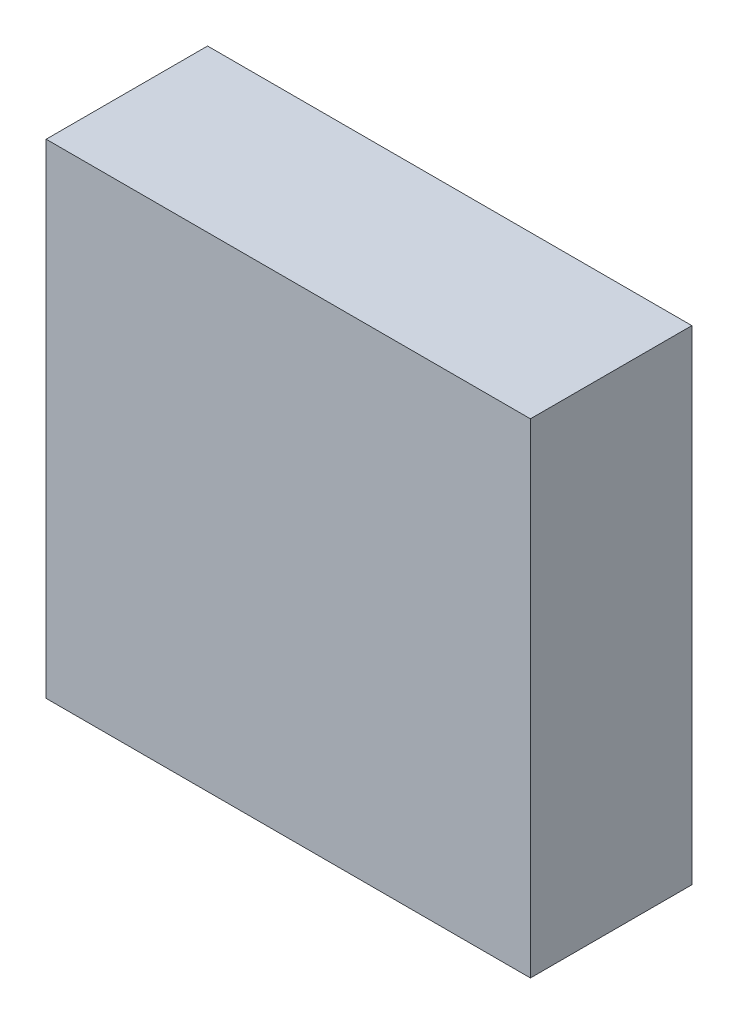
ISO-10303-21;
HEADER;
FILE_DESCRIPTION(('STEP AP214'),'2;1');
FILE_NAME('part.step','',(''),(''),'','','');
FILE_SCHEMA(('AUTOMOTIVE_DESIGN { 1 0 10303 214 1 1 1 1 }'));
ENDSEC;
DATA;
#1=APPLICATION_CONTEXT('core data for automotive mechanical design processes');
#2=APPLICATION_PROTOCOL_DEFINITION('international standard','automotive_design',2000,#1);
#3=PRODUCT_CONTEXT('',#1,'mechanical');
#4=PRODUCT('Part','Part','',(#3));
#5=PRODUCT_RELATED_PRODUCT_CATEGORY('part','',(#4));
#6=PRODUCT_DEFINITION_FORMATION('','',#4);
#7=PRODUCT_DEFINITION_CONTEXT('part definition',#1,'design');
#8=PRODUCT_DEFINITION('design','',#6,#7);
#9=PRODUCT_DEFINITION_SHAPE('','',#8);
#10=(LENGTH_UNIT() NAMED_UNIT(*) SI_UNIT(.MILLI.,.METRE.));
#11=(NAMED_UNIT(*) PLANE_ANGLE_UNIT() SI_UNIT($,.RADIAN.));
#12=(NAMED_UNIT(*) SI_UNIT($,.STERADIAN.) SOLID_ANGLE_UNIT());
#13=UNCERTAINTY_MEASURE_WITH_UNIT(LENGTH_MEASURE(1.E-05),#10,'distance_accuracy_value','');
#14=(GEOMETRIC_REPRESENTATION_CONTEXT(3) GLOBAL_UNCERTAINTY_ASSIGNED_CONTEXT((#13)) GLOBAL_UNIT_ASSIGNED_CONTEXT((#10,
#11,#12)) REPRESENTATION_CONTEXT('',''));
#15=CARTESIAN_POINT('',(0.,0.,0.));
#16=DIRECTION('',(0.,0.,1.));
#17=DIRECTION('',(1.,0.,0.));
#18=AXIS2_PLACEMENT_3D('',#15,#16,#17);
#19=CARTESIAN_POINT('',(1.49998176,-1.49998176,0.));
#20=DIRECTION('',(0.,0.,-1.));
#21=DIRECTION('',(-1.,0.,0.));
#22=AXIS2_PLACEMENT_3D('',#19,#20,#21);
#23=PLANE('',#22);
#24=DIRECTION('',(1.,0.,0.));
#25=VECTOR('',#24,1.);
#26=CARTESIAN_POINT('',(1.49998176,1.49998176,0.));
#27=LINE('',#26,#25);
#28=CARTESIAN_POINT('',(-1.49998176,1.49998176,0.));
#29=VERTEX_POINT('',#28);
#30=CARTESIAN_POINT('',(1.49998176,1.49998176,0.));
#31=VERTEX_POINT('',#30);
#32=EDGE_CURVE('E75',#29,#31,#27,.T.);
#33=ORIENTED_EDGE('',*,*,#32,.T.);
#34=DIRECTION('',(0.,1.,0.));
#35=VECTOR('',#34,1.);
#36=CARTESIAN_POINT('',(1.49998176,-1.49998176,0.));
#37=LINE('',#36,#35);
#38=CARTESIAN_POINT('',(1.49998176,-1.49998176,0.));
#39=VERTEX_POINT('',#38);
#40=EDGE_CURVE('E57',#31,#39,#37,.F.);
#41=ORIENTED_EDGE('',*,*,#40,.T.);
#42=DIRECTION('',(1.,0.,0.));
#43=VECTOR('',#42,1.);
#44=CARTESIAN_POINT('',(-1.49998176,-1.49998176,0.));
#45=LINE('',#44,#43);
#46=CARTESIAN_POINT('',(-1.49998176,-1.49998176,0.));
#47=VERTEX_POINT('',#46);
#48=EDGE_CURVE('E19',#39,#47,#45,.F.);
#49=ORIENTED_EDGE('',*,*,#48,.T.);
#50=DIRECTION('',(0.,1.,0.));
#51=VECTOR('',#50,1.);
#52=CARTESIAN_POINT('',(-1.49998176,1.49998176,0.));
#53=LINE('',#52,#51);
#54=EDGE_CURVE('E54',#47,#29,#53,.T.);
#55=ORIENTED_EDGE('',*,*,#54,.T.);
#56=EDGE_LOOP('',(#33,#41,#49,#55));
#57=FACE_BOUND('',#56,.T.);
#58=ADVANCED_FACE('F16',(#57),#23,.T.);
#59=CARTESIAN_POINT('',(-1.49998176,-1.49998176,0.));
#60=DIRECTION('',(0.,1.,0.));
#61=DIRECTION('',(0.,0.,1.));
#62=AXIS2_PLACEMENT_3D('',#59,#60,#61);
#63=PLANE('',#62);
#64=DIRECTION('',(0.,0.,1.));
#65=VECTOR('',#64,1.);
#66=CARTESIAN_POINT('',(1.49998176,-1.49998176,0.));
#67=LINE('',#66,#65);
#68=CARTESIAN_POINT('',(1.49998176,-1.49998176,1.00000054));
#69=VERTEX_POINT('',#68);
#70=EDGE_CURVE('E77',#39,#69,#67,.T.);
#71=ORIENTED_EDGE('',*,*,#70,.T.);
#72=DIRECTION('',(-1.,0.,0.));
#73=VECTOR('',#72,1.);
#74=CARTESIAN_POINT('',(1.49998176,-1.49998176,1.00000054));
#75=LINE('',#74,#73);
#76=CARTESIAN_POINT('',(-1.49998176,-1.49998176,1.00000054));
#77=VERTEX_POINT('',#76);
#78=EDGE_CURVE('E72',#69,#77,#75,.T.);
#79=ORIENTED_EDGE('',*,*,#78,.T.);
#80=DIRECTION('',(0.,0.,-1.));
#81=VECTOR('',#80,1.);
#82=CARTESIAN_POINT('',(-1.49998176,-1.49998176,0.));
#83=LINE('',#82,#81);
#84=EDGE_CURVE('E62',#77,#47,#83,.T.);
#85=ORIENTED_EDGE('',*,*,#84,.T.);
#86=ORIENTED_EDGE('',*,*,#48,.F.);
#87=EDGE_LOOP('',(#71,#79,#85,#86));
#88=FACE_BOUND('',#87,.T.);
#89=ADVANCED_FACE('F71',(#88),#63,.F.);
#90=CARTESIAN_POINT('',(-1.49998176,1.49998176,0.));
#91=DIRECTION('',(1.,0.,0.));
#92=DIRECTION('',(0.,0.,-1.));
#93=AXIS2_PLACEMENT_3D('',#90,#91,#92);
#94=PLANE('',#93);
#95=ORIENTED_EDGE('',*,*,#84,.F.);
#96=DIRECTION('',(0.,1.,0.));
#97=VECTOR('',#96,1.);
#98=CARTESIAN_POINT('',(-1.49998176,-1.49998176,1.00000054));
#99=LINE('',#98,#97);
#100=CARTESIAN_POINT('',(-1.49998176,1.49998176,1.00000054));
#101=VERTEX_POINT('',#100);
#102=EDGE_CURVE('E82',#77,#101,#99,.T.);
#103=ORIENTED_EDGE('',*,*,#102,.T.);
#104=DIRECTION('',(0.,0.,-1.));
#105=VECTOR('',#104,1.);
#106=CARTESIAN_POINT('',(-1.49998176,1.49998176,0.));
#107=LINE('',#106,#105);
#108=EDGE_CURVE('E68',#101,#29,#107,.T.);
#109=ORIENTED_EDGE('',*,*,#108,.T.);
#110=ORIENTED_EDGE('',*,*,#54,.F.);
#111=EDGE_LOOP('',(#95,#103,#109,#110));
#112=FACE_BOUND('',#111,.T.);
#113=ADVANCED_FACE('F65',(#112),#94,.F.);
#114=CARTESIAN_POINT('',(1.49998176,1.49998176,0.));
#115=DIRECTION('',(0.,-1.,0.));
#116=DIRECTION('',(0.,0.,-1.));
#117=AXIS2_PLACEMENT_3D('',#114,#115,#116);
#118=PLANE('',#117);
#119=ORIENTED_EDGE('',*,*,#108,.F.);
#120=DIRECTION('',(-1.,0.,0.));
#121=VECTOR('',#120,1.);
#122=CARTESIAN_POINT('',(1.49998176,1.49998176,1.00000054));
#123=LINE('',#122,#121);
#124=CARTESIAN_POINT('',(1.49998176,1.49998176,1.00000054));
#125=VERTEX_POINT('',#124);
#126=EDGE_CURVE('E25',#101,#125,#123,.F.);
#127=ORIENTED_EDGE('',*,*,#126,.T.);
#128=DIRECTION('',(0.,0.,1.));
#129=VECTOR('',#128,1.);
#130=CARTESIAN_POINT('',(1.49998176,1.49998176,0.));
#131=LINE('',#130,#129);
#132=EDGE_CURVE('E33',#125,#31,#131,.F.);
#133=ORIENTED_EDGE('',*,*,#132,.T.);
#134=ORIENTED_EDGE('',*,*,#32,.F.);
#135=EDGE_LOOP('',(#119,#127,#133,#134));
#136=FACE_BOUND('',#135,.T.);
#137=ADVANCED_FACE('F87',(#136),#118,.F.);
#138=CARTESIAN_POINT('',(1.49998176,-1.49998176,0.));
#139=DIRECTION('',(-1.,0.,0.));
#140=DIRECTION('',(0.,0.,1.));
#141=AXIS2_PLACEMENT_3D('',#138,#139,#140);
#142=PLANE('',#141);
#143=ORIENTED_EDGE('',*,*,#132,.F.);
#144=DIRECTION('',(0.,1.,0.));
#145=VECTOR('',#144,1.);
#146=CARTESIAN_POINT('',(1.49998176,-1.49998176,1.00000054));
#147=LINE('',#146,#145);
#148=EDGE_CURVE('E11',#125,#69,#147,.F.);
#149=ORIENTED_EDGE('',*,*,#148,.T.);
#150=ORIENTED_EDGE('',*,*,#70,.F.);
#151=ORIENTED_EDGE('',*,*,#40,.F.);
#152=EDGE_LOOP('',(#143,#149,#150,#151));
#153=FACE_BOUND('',#152,.T.);
#154=ADVANCED_FACE('F90',(#153),#142,.F.);
#155=CARTESIAN_POINT('',(1.49998176,-1.49998176,1.00000054));
#156=DIRECTION('',(0.,0.,-1.));
#157=DIRECTION('',(-1.,0.,0.));
#158=AXIS2_PLACEMENT_3D('',#155,#156,#157);
#159=PLANE('',#158);
#160=ORIENTED_EDGE('',*,*,#126,.F.);
#161=ORIENTED_EDGE('',*,*,#102,.F.);
#162=ORIENTED_EDGE('',*,*,#78,.F.);
#163=ORIENTED_EDGE('',*,*,#148,.F.);
#164=EDGE_LOOP('',(#160,#161,#162,#163));
#165=FACE_BOUND('',#164,.T.);
#166=ADVANCED_FACE('F89',(#165),#159,.F.);
#167=CLOSED_SHELL('',(#58,#89,#113,#137,#154,#166));
#168=MANIFOLD_SOLID_BREP('B1',#167);
#169=ADVANCED_BREP_SHAPE_REPRESENTATION('',(#18,#168),#14);
#170=SHAPE_DEFINITION_REPRESENTATION(#9,#169);
ENDSEC;
END-ISO-10303-21;
